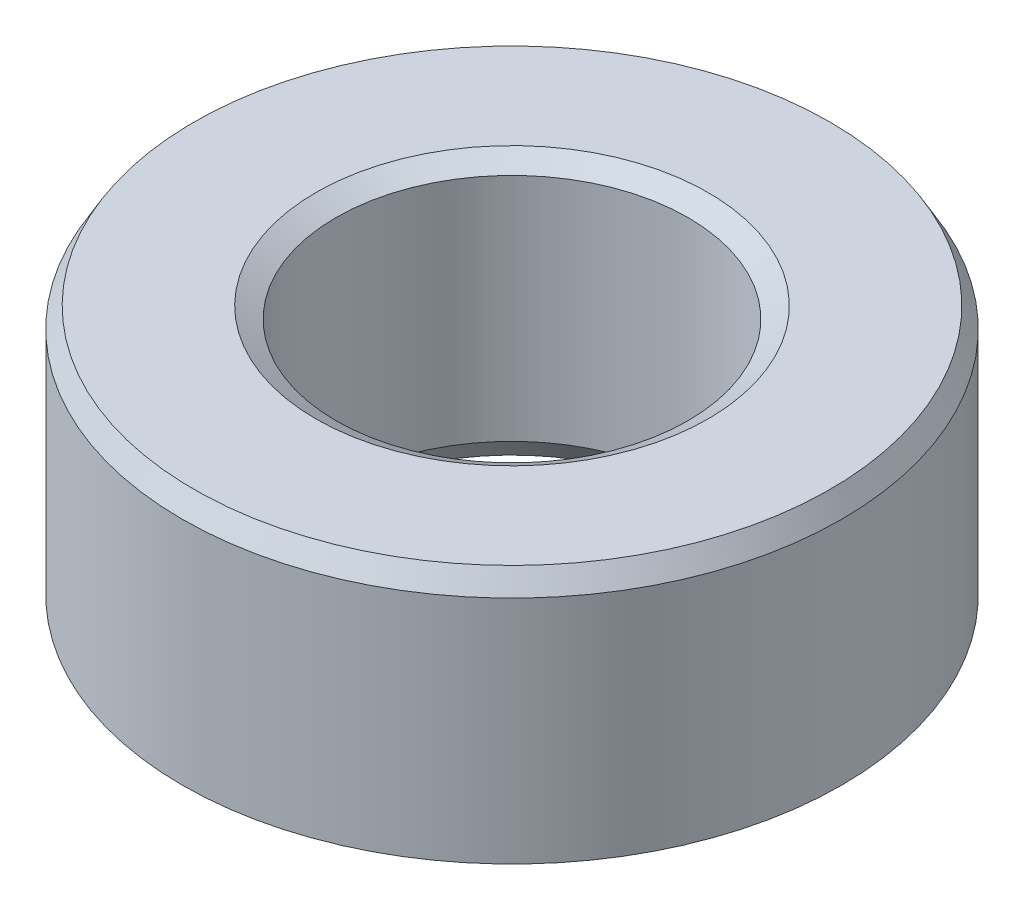
ISO-10303-21;
HEADER;
FILE_DESCRIPTION(('STEP AP214'),'2;1');
FILE_NAME('part.step','',(''),(''),'','','');
FILE_SCHEMA(('AUTOMOTIVE_DESIGN { 1 0 10303 214 1 1 1 1 }'));
ENDSEC;
DATA;
#1=APPLICATION_CONTEXT('core data for automotive mechanical design processes');
#2=APPLICATION_PROTOCOL_DEFINITION('international standard','automotive_design',2000,#1);
#3=PRODUCT_CONTEXT('',#1,'mechanical');
#4=PRODUCT('Part','Part','',(#3));
#5=PRODUCT_RELATED_PRODUCT_CATEGORY('part','',(#4));
#6=PRODUCT_DEFINITION_FORMATION('','',#4);
#7=PRODUCT_DEFINITION_CONTEXT('part definition',#1,'design');
#8=PRODUCT_DEFINITION('design','',#6,#7);
#9=PRODUCT_DEFINITION_SHAPE('','',#8);
#10=(LENGTH_UNIT() NAMED_UNIT(*) SI_UNIT(.MILLI.,.METRE.));
#11=(NAMED_UNIT(*) PLANE_ANGLE_UNIT() SI_UNIT($,.RADIAN.));
#12=(NAMED_UNIT(*) SI_UNIT($,.STERADIAN.) SOLID_ANGLE_UNIT());
#13=UNCERTAINTY_MEASURE_WITH_UNIT(LENGTH_MEASURE(1.E-05),#10,'distance_accuracy_value','');
#14=(GEOMETRIC_REPRESENTATION_CONTEXT(3) GLOBAL_UNCERTAINTY_ASSIGNED_CONTEXT((#13)) GLOBAL_UNIT_ASSIGNED_CONTEXT((#10,
#11,#12)) REPRESENTATION_CONTEXT('',''));
#15=CARTESIAN_POINT('',(0.,0.,0.));
#16=DIRECTION('',(0.,0.,1.));
#17=DIRECTION('',(1.,0.,0.));
#18=AXIS2_PLACEMENT_3D('',#15,#16,#17);
#19=CARTESIAN_POINT('',(0.,33.7743157679343,0.));
#20=DIRECTION('',(0.,-1.,0.));
#21=DIRECTION('',(0.,0.,-1.));
#22=AXIS2_PLACEMENT_3D('',#19,#20,#21);
#23=CYLINDRICAL_SURFACE('',#22,42.5);
#24=CARTESIAN_POINT('',(0.,1.49606592272024,0.));
#25=DIRECTION('',(0.,1.,0.));
#26=DIRECTION('',(0.,0.,1.));
#27=AXIS2_PLACEMENT_3D('',#24,#25,#26);
#28=CIRCLE('',#27,42.5);
#29=CARTESIAN_POINT('',(0.,1.49606592272024,42.5));
#30=VERTEX_POINT('',#29);
#31=EDGE_CURVE('E10',#30,#30,#28,.T.);
#32=ORIENTED_EDGE('',*,*,#31,.T.);
#33=EDGE_LOOP('',(#32));
#34=FACE_BOUND('',#33,.T.);
#35=CARTESIAN_POINT('',(0.,31.1830535783104,0.));
#36=DIRECTION('',(0.,1.,0.));
#37=DIRECTION('',(0.,0.,1.));
#38=AXIS2_PLACEMENT_3D('',#35,#36,#37);
#39=CIRCLE('',#38,42.5);
#40=CARTESIAN_POINT('',(0.,31.1830535783104,-42.5));
#41=VERTEX_POINT('',#40);
#42=EDGE_CURVE('E50',#41,#41,#39,.F.);
#43=ORIENTED_EDGE('',*,*,#42,.T.);
#44=EDGE_LOOP('',(#43));
#45=FACE_BOUND('',#44,.T.);
#46=ADVANCED_FACE('F39',(#34,#45),#23,.T.);
#47=CARTESIAN_POINT('',(0.,33.7743157679343,0.));
#48=DIRECTION('',(0.,1.,0.));
#49=DIRECTION('',(0.,0.,1.));
#50=AXIS2_PLACEMENT_3D('',#47,#48,#49);
#51=PLANE('',#50);
#52=CARTESIAN_POINT('',(0.,33.7743157679343,0.));
#53=DIRECTION('',(0.,1.,0.));
#54=DIRECTION('',(0.,0.,1.));
#55=AXIS2_PLACEMENT_3D('',#52,#53,#54);
#56=CIRCLE('',#55,25.2810398980472);
#57=CARTESIAN_POINT('',(0.,33.7743157679343,25.2810398980472));
#58=VERTEX_POINT('',#57);
#59=EDGE_CURVE('E58',#58,#58,#56,.F.);
#60=ORIENTED_EDGE('',*,*,#59,.T.);
#61=EDGE_LOOP('',(#60));
#62=FACE_BOUND('',#61,.T.);
#63=CARTESIAN_POINT('',(0.,33.7743157679343,0.));
#64=DIRECTION('',(0.,1.,0.));
#65=DIRECTION('',(0.,0.,1.));
#66=AXIS2_PLACEMENT_3D('',#63,#64,#65);
#67=CIRCLE('',#66,41.0039340772798);
#68=CARTESIAN_POINT('',(0.,33.7743157679342,-41.0039340772798));
#69=VERTEX_POINT('',#68);
#70=EDGE_CURVE('E61',#69,#69,#67,.T.);
#71=ORIENTED_EDGE('',*,*,#70,.T.);
#72=EDGE_LOOP('',(#71));
#73=FACE_BOUND('',#72,.T.);
#74=ADVANCED_FACE('F88',(#62,#73),#51,.T.);
#75=CARTESIAN_POINT('',(0.,0.,0.));
#76=DIRECTION('',(0.,1.,0.));
#77=DIRECTION('',(0.,0.,1.));
#78=AXIS2_PLACEMENT_3D('',#75,#76,#77);
#79=PLANE('',#78);
#80=CARTESIAN_POINT('',(0.,0.,0.));
#81=DIRECTION('',(0.,1.,0.));
#82=DIRECTION('',(0.,0.,1.));
#83=AXIS2_PLACEMENT_3D('',#80,#81,#82);
#84=CIRCLE('',#83,24.1858436311436);
#85=CARTESIAN_POINT('',(0.,0.,-24.1858436311436));
#86=VERTEX_POINT('',#85);
#87=EDGE_CURVE('E51',#86,#86,#84,.T.);
#88=ORIENTED_EDGE('',*,*,#87,.T.);
#89=EDGE_LOOP('',(#88));
#90=FACE_BOUND('',#89,.T.);
#91=CARTESIAN_POINT('',(0.,0.,0.));
#92=DIRECTION('',(0.,1.,0.));
#93=DIRECTION('',(0.,0.,1.));
#94=AXIS2_PLACEMENT_3D('',#91,#92,#93);
#95=CIRCLE('',#94,39.9087378103761);
#96=CARTESIAN_POINT('',(0.,0.,39.9087378103761));
#97=VERTEX_POINT('',#96);
#98=EDGE_CURVE('E54',#97,#97,#95,.F.);
#99=ORIENTED_EDGE('',*,*,#98,.T.);
#100=EDGE_LOOP('',(#99));
#101=FACE_BOUND('',#100,.T.);
#102=ADVANCED_FACE('F83',(#90,#101),#79,.F.);
#103=CARTESIAN_POINT('',(0.,33.7743157679343,0.));
#104=DIRECTION('',(0.,-1.,0.));
#105=DIRECTION('',(0.,0.,-1.));
#106=AXIS2_PLACEMENT_3D('',#103,#104,#105);
#107=CYLINDRICAL_SURFACE('',#106,22.6897777084233);
#108=CARTESIAN_POINT('',(0.,32.278249845214,0.));
#109=DIRECTION('',(0.,1.,0.));
#110=DIRECTION('',(0.,0.,1.));
#111=AXIS2_PLACEMENT_3D('',#108,#109,#110);
#112=CIRCLE('',#111,22.6897777084233);
#113=CARTESIAN_POINT('',(0.,32.278249845214,22.6897777084233));
#114=VERTEX_POINT('',#113);
#115=EDGE_CURVE('E67',#114,#114,#112,.T.);
#116=ORIENTED_EDGE('',*,*,#115,.T.);
#117=EDGE_LOOP('',(#116));
#118=FACE_BOUND('',#117,.T.);
#119=CARTESIAN_POINT('',(0.,2.5912621896239,0.));
#120=DIRECTION('',(0.,1.,0.));
#121=DIRECTION('',(0.,0.,1.));
#122=AXIS2_PLACEMENT_3D('',#119,#120,#121);
#123=CIRCLE('',#122,22.6897777084233);
#124=CARTESIAN_POINT('',(0.,2.5912621896239,-22.6897777084233));
#125=VERTEX_POINT('',#124);
#126=EDGE_CURVE('E69',#125,#125,#123,.F.);
#127=ORIENTED_EDGE('',*,*,#126,.T.);
#128=EDGE_LOOP('',(#127));
#129=FACE_BOUND('',#128,.T.);
#130=ADVANCED_FACE('F71',(#118,#129),#107,.F.);
#131=CARTESIAN_POINT('',(0.,32.278249845214,0.));
#132=DIRECTION('',(0.,1.,0.));
#133=DIRECTION('',(0.,0.,1.));
#134=AXIS2_PLACEMENT_3D('',#131,#132,#133);
#135=CONICAL_SURFACE('',#134,22.6897777084233,1.0471975511966);
#136=ORIENTED_EDGE('',*,*,#59,.F.);
#137=EDGE_LOOP('',(#136));
#138=FACE_BOUND('',#137,.T.);
#139=ORIENTED_EDGE('',*,*,#115,.F.);
#140=EDGE_LOOP('',(#139));
#141=FACE_BOUND('',#140,.T.);
#142=ADVANCED_FACE('F77',(#138,#141),#135,.F.);
#143=CARTESIAN_POINT('',(0.,0.,0.));
#144=DIRECTION('',(0.,-1.,0.));
#145=DIRECTION('',(0.,0.,-1.));
#146=AXIS2_PLACEMENT_3D('',#143,#144,#145);
#147=CONICAL_SURFACE('',#146,24.1858436311436,0.523598775598294);
#148=CARTESIAN_POINT('',(0.,2.5912621896239,-22.6897777084233));
#149=CARTESIAN_POINT('',(0.,2.56426987514865,-22.7053617284517));
#150=CARTESIAN_POINT('',(0.,2.5372775606734,-22.72094574848));
#151=CARTESIAN_POINT('',(0.,2.4832929317229,-22.7521137885367));
#152=CARTESIAN_POINT('',(0.,2.45630061724765,-22.767697808565));
#153=CARTESIAN_POINT('',(0.,2.40231598829715,-22.7988658486217));
#154=CARTESIAN_POINT('',(0.,2.37532367382191,-22.81444986865));
#155=CARTESIAN_POINT('',(0.,2.32133904487141,-22.8456179087067));
#156=CARTESIAN_POINT('',(0.,2.29434673039616,-22.861201928735));
#157=CARTESIAN_POINT('',(0.,2.24036210144566,-22.8923699687917));
#158=CARTESIAN_POINT('',(0.,2.21336978697041,-22.90795398882));
#159=CARTESIAN_POINT('',(0.,2.15938515801991,-22.9391220288767));
#160=CARTESIAN_POINT('',(0.,2.13239284354467,-22.9547060489051));
#161=CARTESIAN_POINT('',(0.,2.07840821459417,-22.9858740889617));
#162=CARTESIAN_POINT('',(0.,2.05141590011892,-23.0014581089901));
#163=CARTESIAN_POINT('',(0.,1.99743127116842,-23.0326261490467));
#164=CARTESIAN_POINT('',(0.,1.97043895669317,-23.0482101690751));
#165=CARTESIAN_POINT('',(0.,1.91645432774267,-23.0793782091317));
#166=CARTESIAN_POINT('',(0.,1.88946201326742,-23.0949622291601));
#167=CARTESIAN_POINT('',(0.,1.83547738431693,-23.1261302692167));
#168=CARTESIAN_POINT('',(0.,1.80848506984168,-23.1417142892451));
#169=CARTESIAN_POINT('',(0.,1.75450044089118,-23.1728823293017));
#170=CARTESIAN_POINT('',(0.,1.72750812641593,-23.1884663493301));
#171=CARTESIAN_POINT('',(0.,1.67352349746543,-23.2196343893868));
#172=CARTESIAN_POINT('',(0.,1.64653118299018,-23.2352184094151));
#173=CARTESIAN_POINT('',(0.,1.59254655403969,-23.2663864494718));
#174=CARTESIAN_POINT('',(0.,1.56555423956444,-23.2819704695001));
#175=CARTESIAN_POINT('',(0.,1.51156961061394,-23.3131385095568));
#176=CARTESIAN_POINT('',(0.,1.48457729613869,-23.3287225295851));
#177=CARTESIAN_POINT('',(0.,1.43059266718819,-23.3598905696418));
#178=CARTESIAN_POINT('',(0.,1.40360035271294,-23.3754745896701));
#179=CARTESIAN_POINT('',(0.,1.34961572376245,-23.4066426297268));
#180=CARTESIAN_POINT('',(0.,1.3226234092872,-23.4222266497551));
#181=CARTESIAN_POINT('',(0.,1.2686387803367,-23.4533946898118));
#182=CARTESIAN_POINT('',(0.,1.24164646586145,-23.4689787098401));
#183=CARTESIAN_POINT('',(0.,1.18766183691095,-23.5001467498968));
#184=CARTESIAN_POINT('',(0.,1.1606695224357,-23.5157307699251));
#185=CARTESIAN_POINT('',(0.,1.10668489348521,-23.5468988099818));
#186=CARTESIAN_POINT('',(0.,1.07969257900996,-23.5624828300101));
#187=CARTESIAN_POINT('',(0.,1.02570795005946,-23.5936508700668));
#188=CARTESIAN_POINT('',(0.,0.99871563558421,-23.6092348900952));
#189=CARTESIAN_POINT('',(0.,0.944731006633712,-23.6404029301518));
#190=CARTESIAN_POINT('',(0.,0.917738692158464,-23.6559869501802));
#191=CARTESIAN_POINT('',(0.,0.863754063207966,-23.6871549902368));
#192=CARTESIAN_POINT('',(0.,0.836761748732717,-23.7027390102652));
#193=CARTESIAN_POINT('',(0.,0.782777119782219,-23.7339070503218));
#194=CARTESIAN_POINT('',(0.,0.75578480530697,-23.7494910703502));
#195=CARTESIAN_POINT('',(0.,0.701800176356472,-23.7806591104068));
#196=CARTESIAN_POINT('',(0.,0.674807861881223,-23.7962431304352));
#197=CARTESIAN_POINT('',(0.,0.620823232930725,-23.8274111704919));
#198=CARTESIAN_POINT('',(0.,0.593830918455476,-23.8429951905202));
#199=CARTESIAN_POINT('',(0.,0.539846289504978,-23.8741632305769));
#200=CARTESIAN_POINT('',(0.,0.51285397502973,-23.8897472506052));
#201=CARTESIAN_POINT('',(0.,0.458869346079232,-23.9209152906619));
#202=CARTESIAN_POINT('',(0.,0.431877031603982,-23.9364993106902));
#203=CARTESIAN_POINT('',(0.,0.377892402653485,-23.9676673507469));
#204=CARTESIAN_POINT('',(0.,0.350900088178236,-23.9832513707752));
#205=CARTESIAN_POINT('',(0.,0.296915459227738,-24.0144194108319));
#206=CARTESIAN_POINT('',(0.,0.269923144752489,-24.0300034308602));
#207=CARTESIAN_POINT('',(0.,0.215938515801991,-24.0611714709169));
#208=CARTESIAN_POINT('',(0.,0.188946201326742,-24.0767554909452));
#209=CARTESIAN_POINT('',(0.,0.134961572376245,-24.1079235310019));
#210=CARTESIAN_POINT('',(0.,0.107969257900996,-24.1235075510302));
#211=CARTESIAN_POINT('',(0.,0.0539846289504978,-24.1546755910869));
#212=CARTESIAN_POINT('',(0.,0.0269923144752489,-24.1702596111152));
#213=CARTESIAN_POINT('',(0.,0.,-24.1858436311436));
#214=B_SPLINE_CURVE_WITH_KNOTS('',3,(#148,#149,#150,#151,#152,#153,#154,#155,#156,#157,#158,
#159,#160,#161,#162,#163,#164,#165,#166,#167,#168,#169,#170,#171,#172,#173,#174,#175,#176,#177,
#178,#179,#180,#181,#182,#183,#184,#185,#186,#187,#188,#189,#190,#191,#192,#193,#194,#195,#196,
#197,#198,#199,#200,#201,#202,#203,#204,#205,#206,#207,#208,#209,#210,#211,#212,#213),
.UNSPECIFIED.,.F.,.F.,(4,2,2,2,2,2,2,2,2,2,2,2,2,2,2,2,2,2,2,2,2,2,2,2,2,2,2,2,2,2,2,2,4),(0.,
0.0935041201700155,0.187008240340031,0.280512360510047,0.374016480680062,0.467520600850079,
0.561024721020095,0.65452884119011,0.748032961360126,0.841537081530141,0.935041201700157,
1.02854532187017,1.12204944204019,1.21555356221021,1.30905768238022,1.40256180255024,
1.49606592272025,1.58957004289027,1.68307416306028,1.7765782832303,1.87008240340031,
1.96358652357033,2.05709064374035,2.15059476391036,2.24409888408038,2.33760300425039,
2.43110712442041,2.52461124459042,2.61811536476044,2.71161948493046,2.80512360510047,
2.89862772527049,2.9921318454405),.UNSPECIFIED.);
#215=EDGE_CURVE('BSEAM73',#125,#86,#214,.T.);
#216=ORIENTED_EDGE('',*,*,#126,.F.);
#217=ORIENTED_EDGE('',*,*,#87,.F.);
#218=ORIENTED_EDGE('',*,*,#215,.T.);
#219=ORIENTED_EDGE('',*,*,#215,.F.);
#220=EDGE_LOOP('',(#216,#218,#217,#219));
#221=FACE_BOUND('',#220,.T.);
#222=ADVANCED_FACE('F73',(#221),#147,.F.);
#223=CARTESIAN_POINT('',(0.,1.49606592272024,0.));
#224=DIRECTION('',(0.,1.,0.));
#225=DIRECTION('',(0.,0.,1.));
#226=AXIS2_PLACEMENT_3D('',#223,#224,#225);
#227=CONICAL_SURFACE('',#226,42.5,1.0471975511966);
#228=ORIENTED_EDGE('',*,*,#98,.F.);
#229=EDGE_LOOP('',(#228));
#230=FACE_BOUND('',#229,.T.);
#231=ORIENTED_EDGE('',*,*,#31,.F.);
#232=EDGE_LOOP('',(#231));
#233=FACE_BOUND('',#232,.T.);
#234=ADVANCED_FACE('F76',(#230,#233),#227,.T.);
#235=CARTESIAN_POINT('',(0.,33.7743157679343,0.));
#236=DIRECTION('',(0.,-1.,0.));
#237=DIRECTION('',(0.,0.,-1.));
#238=AXIS2_PLACEMENT_3D('',#235,#236,#237);
#239=CONICAL_SURFACE('',#238,41.0039340772798,0.523598775598298);
#240=CARTESIAN_POINT('',(0.,31.1830535783104,-42.5));
#241=CARTESIAN_POINT('',(0.,31.2100458927856,-42.4844159799717));
#242=CARTESIAN_POINT('',(0.,31.2370382072609,-42.4688319599433));
#243=CARTESIAN_POINT('',(0.,31.2910228362114,-42.4376639198867));
#244=CARTESIAN_POINT('',(0.,31.3180151506866,-42.4220798998583));
#245=CARTESIAN_POINT('',(0.,31.3719997796371,-42.3909118598017));
#246=CARTESIAN_POINT('',(0.,31.3989920941124,-42.3753278397733));
#247=CARTESIAN_POINT('',(0.,31.4529767230628,-42.3441597997167));
#248=CARTESIAN_POINT('',(0.,31.4799690375381,-42.3285757796883));
#249=CARTESIAN_POINT('',(0.,31.5339536664886,-42.2974077396316));
#250=CARTESIAN_POINT('',(0.,31.5609459809638,-42.2818237196033));
#251=CARTESIAN_POINT('',(0.,31.6149306099143,-42.2506556795466));
#252=CARTESIAN_POINT('',(0.,31.6419229243896,-42.2350716595183));
#253=CARTESIAN_POINT('',(0.,31.6959075533401,-42.2039036194616));
#254=CARTESIAN_POINT('',(0.,31.7228998678153,-42.1883195994333));
#255=CARTESIAN_POINT('',(0.,31.7768844967658,-42.1571515593766));
#256=CARTESIAN_POINT('',(0.,31.8038768112411,-42.1415675393483));
#257=CARTESIAN_POINT('',(0.,31.8578614401916,-42.1103994992916));
#258=CARTESIAN_POINT('',(0.,31.8848537546668,-42.0948154792633));
#259=CARTESIAN_POINT('',(0.,31.9388383836173,-42.0636474392066));
#260=CARTESIAN_POINT('',(0.,31.9658306980926,-42.0480634191783));
#261=CARTESIAN_POINT('',(0.,32.0198153270431,-42.0168953791216));
#262=CARTESIAN_POINT('',(0.,32.0468076415183,-42.0013113590933));
#263=CARTESIAN_POINT('',(0.,32.1007922704688,-41.9701433190366));
#264=CARTESIAN_POINT('',(0.,32.1277845849441,-41.9545592990083));
#265=CARTESIAN_POINT('',(0.,32.1817692138946,-41.9233912589516));
#266=CARTESIAN_POINT('',(0.,32.2087615283698,-41.9078072389232));
#267=CARTESIAN_POINT('',(0.,32.2627461573203,-41.8766391988666));
#268=CARTESIAN_POINT('',(0.,32.2897384717956,-41.8610551788382));
#269=CARTESIAN_POINT('',(0.,32.3437231007461,-41.8298871387816));
#270=CARTESIAN_POINT('',(0.,32.3707154152213,-41.8143031187532));
#271=CARTESIAN_POINT('',(0.,32.4247000441718,-41.7831350786966));
#272=CARTESIAN_POINT('',(0.,32.4516923586471,-41.7675510586682));
#273=CARTESIAN_POINT('',(0.,32.5056769875976,-41.7363830186116));
#274=CARTESIAN_POINT('',(0.,32.5326693020728,-41.7207989985832));
#275=CARTESIAN_POINT('',(0.,32.5866539310233,-41.6896309585265));
#276=CARTESIAN_POINT('',(0.,32.6136462454986,-41.6740469384982));
#277=CARTESIAN_POINT('',(0.,32.667630874449,-41.6428788984415));
#278=CARTESIAN_POINT('',(0.,32.6946231889243,-41.6272948784132));
#279=CARTESIAN_POINT('',(0.,32.7486078178748,-41.5961268383565));
#280=CARTESIAN_POINT('',(0.,32.77560013235,-41.5805428183282));
#281=CARTESIAN_POINT('',(0.,32.8295847613005,-41.5493747782715));
#282=CARTESIAN_POINT('',(0.,32.8565770757758,-41.5337907582432));
#283=CARTESIAN_POINT('',(0.,32.9105617047263,-41.5026227181865));
#284=CARTESIAN_POINT('',(0.,32.9375540192015,-41.4870386981582));
#285=CARTESIAN_POINT('',(0.,32.991538648152,-41.4558706581015));
#286=CARTESIAN_POINT('',(0.,33.0185309626273,-41.4402866380732));
#287=CARTESIAN_POINT('',(0.,33.0725155915778,-41.4091185980165));
#288=CARTESIAN_POINT('',(0.,33.099507906053,-41.3935345779882));
#289=CARTESIAN_POINT('',(0.,33.1534925350035,-41.3623665379315));
#290=CARTESIAN_POINT('',(0.,33.1804848494788,-41.3467825179032));
#291=CARTESIAN_POINT('',(0.,33.2344694784293,-41.3156144778465));
#292=CARTESIAN_POINT('',(0.,33.2614617929045,-41.3000304578181));
#293=CARTESIAN_POINT('',(0.,33.315446421855,-41.2688624177615));
#294=CARTESIAN_POINT('',(0.,33.3424387363303,-41.2532783977331));
#295=CARTESIAN_POINT('',(0.,33.3964233652808,-41.2221103576765));
#296=CARTESIAN_POINT('',(0.,33.423415679756,-41.2065263376481));
#297=CARTESIAN_POINT('',(0.,33.4774003087065,-41.1753582975915));
#298=CARTESIAN_POINT('',(0.,33.5043926231818,-41.1597742775631));
#299=CARTESIAN_POINT('',(0.,33.5583772521323,-41.1286062375064));
#300=CARTESIAN_POINT('',(0.,33.5853695666075,-41.1130222174781));
#301=CARTESIAN_POINT('',(0.,33.639354195558,-41.0818541774214));
#302=CARTESIAN_POINT('',(0.,33.6663465100333,-41.0662701573931));
#303=CARTESIAN_POINT('',(0.,33.7203311389838,-41.0351021173364));
#304=CARTESIAN_POINT('',(0.,33.747323453459,-41.0195180973081));
#305=CARTESIAN_POINT('',(0.,33.7743157679343,-41.0039340772798));
#306=B_SPLINE_CURVE_WITH_KNOTS('',3,(#240,#241,#242,#243,#244,#245,#246,#247,#248,#249,#250,
#251,#252,#253,#254,#255,#256,#257,#258,#259,#260,#261,#262,#263,#264,#265,#266,#267,#268,#269,
#270,#271,#272,#273,#274,#275,#276,#277,#278,#279,#280,#281,#282,#283,#284,#285,#286,#287,#288,
#289,#290,#291,#292,#293,#294,#295,#296,#297,#298,#299,#300,#301,#302,#303,#304,#305),
.UNSPECIFIED.,.F.,.F.,(4,2,2,2,2,2,2,2,2,2,2,2,2,2,2,2,2,2,2,2,2,2,2,2,2,2,2,2,2,2,2,2,4),(0.,
0.0935041201700142,0.187008240340035,0.280512360510049,0.374016480680061,0.467520600850081,
0.561024721020096,0.654528841190113,0.748032961360128,0.841537081530145,0.935041201700159,
1.02854532187017,1.12204944204019,1.21555356221021,1.30905768238022,1.40256180255024,
1.49606592272026,1.58957004289027,1.68307416306028,1.7765782832303,1.87008240340032,
1.96358652357034,2.05709064374035,2.15059476391037,2.24409888408038,2.33760300425039,
2.43110712442041,2.52461124459043,2.61811536476045,2.71161948493046,2.80512360510048,
2.89862772527049,2.99213184544051),.UNSPECIFIED.);
#307=EDGE_CURVE('BSEAM45',#41,#69,#306,.T.);
#308=ORIENTED_EDGE('',*,*,#42,.F.);
#309=ORIENTED_EDGE('',*,*,#70,.F.);
#310=ORIENTED_EDGE('',*,*,#307,.T.);
#311=ORIENTED_EDGE('',*,*,#307,.F.);
#312=EDGE_LOOP('',(#308,#310,#309,#311));
#313=FACE_BOUND('',#312,.T.);
#314=ADVANCED_FACE('F45',(#313),#239,.T.);
#315=CLOSED_SHELL('',(#46,#74,#102,#130,#142,#222,#234,#314));
#316=MANIFOLD_SOLID_BREP('B2',#315);
#317=ADVANCED_BREP_SHAPE_REPRESENTATION('',(#18,#316),#14);
#318=SHAPE_DEFINITION_REPRESENTATION(#9,#317);
ENDSEC;
END-ISO-10303-21;
